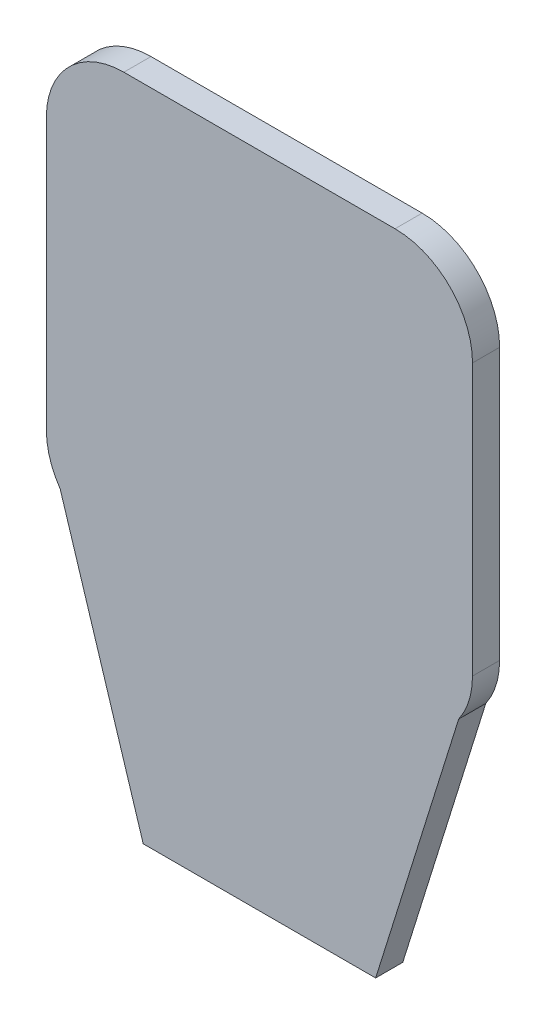
ISO-10303-21;
HEADER;
FILE_DESCRIPTION(('STEP AP214'),'2;1');
FILE_NAME('part.step','',(''),(''),'','','');
FILE_SCHEMA(('AUTOMOTIVE_DESIGN { 1 0 10303 214 1 1 1 1 }'));
ENDSEC;
DATA;
#1=APPLICATION_CONTEXT('core data for automotive mechanical design processes');
#2=APPLICATION_PROTOCOL_DEFINITION('international standard','automotive_design',2000,#1);
#3=PRODUCT_CONTEXT('',#1,'mechanical');
#4=PRODUCT('Part','Part','',(#3));
#5=PRODUCT_RELATED_PRODUCT_CATEGORY('part','',(#4));
#6=PRODUCT_DEFINITION_FORMATION('','',#4);
#7=PRODUCT_DEFINITION_CONTEXT('part definition',#1,'design');
#8=PRODUCT_DEFINITION('design','',#6,#7);
#9=PRODUCT_DEFINITION_SHAPE('','',#8);
#10=(LENGTH_UNIT() NAMED_UNIT(*) SI_UNIT(.MILLI.,.METRE.));
#11=(NAMED_UNIT(*) PLANE_ANGLE_UNIT() SI_UNIT($,.RADIAN.));
#12=(NAMED_UNIT(*) SI_UNIT($,.STERADIAN.) SOLID_ANGLE_UNIT());
#13=UNCERTAINTY_MEASURE_WITH_UNIT(LENGTH_MEASURE(1.E-05),#10,'distance_accuracy_value','');
#14=(GEOMETRIC_REPRESENTATION_CONTEXT(3) GLOBAL_UNCERTAINTY_ASSIGNED_CONTEXT((#13)) GLOBAL_UNIT_ASSIGNED_CONTEXT((#10,
#11,#12)) REPRESENTATION_CONTEXT('',''));
#15=CARTESIAN_POINT('',(0.,0.,0.));
#16=DIRECTION('',(0.,0.,1.));
#17=DIRECTION('',(1.,0.,0.));
#18=AXIS2_PLACEMENT_3D('',#15,#16,#17);
#19=CARTESIAN_POINT('',(15.5923364337388,14.2916666666667,3.5));
#20=DIRECTION('',(0.,0.,-1.));
#21=DIRECTION('',(-1.,0.,0.));
#22=AXIS2_PLACEMENT_3D('',#19,#20,#21);
#23=CYLINDRICAL_SURFACE('',#22,10.);
#24=CARTESIAN_POINT('',(15.5923364337388,14.2916666666667,0.));
#25=DIRECTION('',(0.,0.,1.));
#26=DIRECTION('',(-1.,0.,0.));
#27=AXIS2_PLACEMENT_3D('',#24,#25,#26);
#28=CIRCLE('',#27,10.);
#29=CARTESIAN_POINT('',(25.5923364337388,14.2916666666666,0.));
#30=VERTEX_POINT('',#29);
#31=CARTESIAN_POINT('',(15.5923364337387,24.2916666666667,0.));
#32=VERTEX_POINT('',#31);
#33=EDGE_CURVE('E140',#30,#32,#28,.T.);
#34=ORIENTED_EDGE('',*,*,#33,.T.);
#35=DIRECTION('',(0.,0.,-1.));
#36=VECTOR('',#35,1.);
#37=CARTESIAN_POINT('',(15.5923364337387,24.2916666666667,3.5));
#38=LINE('',#37,#36);
#39=CARTESIAN_POINT('',(15.5923364337387,24.2916666666667,3.5));
#40=VERTEX_POINT('',#39);
#41=EDGE_CURVE('E11',#40,#32,#38,.T.);
#42=ORIENTED_EDGE('',*,*,#41,.F.);
#43=CARTESIAN_POINT('',(15.5923364337388,14.2916666666667,3.5));
#44=DIRECTION('',(0.,0.,1.));
#45=DIRECTION('',(-1.,0.,0.));
#46=AXIS2_PLACEMENT_3D('',#43,#44,#45);
#47=CIRCLE('',#46,10.);
#48=CARTESIAN_POINT('',(25.5923364337388,14.2916666666666,3.5));
#49=VERTEX_POINT('',#48);
#50=EDGE_CURVE('E158',#49,#40,#47,.T.);
#51=ORIENTED_EDGE('',*,*,#50,.F.);
#52=DIRECTION('',(0.,0.,-1.));
#53=VECTOR('',#52,1.);
#54=CARTESIAN_POINT('',(25.5923364337388,14.2916666666666,3.5));
#55=LINE('',#54,#53);
#56=EDGE_CURVE('E136',#49,#30,#55,.T.);
#57=ORIENTED_EDGE('',*,*,#56,.T.);
#58=EDGE_LOOP('',(#34,#42,#51,#57));
#59=FACE_BOUND('',#58,.T.);
#60=ADVANCED_FACE('F32',(#59),#23,.T.);
#61=CARTESIAN_POINT('',(-19.4076635662612,24.2916666666667,3.5));
#62=DIRECTION('',(0.,-1.,0.));
#63=DIRECTION('',(0.,0.,-1.));
#64=AXIS2_PLACEMENT_3D('',#61,#62,#63);
#65=PLANE('',#64);
#66=DIRECTION('',(-1.,0.,0.));
#67=VECTOR('',#66,1.);
#68=CARTESIAN_POINT('',(-19.4076635662612,24.2916666666667,0.));
#69=LINE('',#68,#67);
#70=CARTESIAN_POINT('',(-19.4076635662612,24.2916666666667,0.));
#71=VERTEX_POINT('',#70);
#72=EDGE_CURVE('E143',#32,#71,#69,.T.);
#73=ORIENTED_EDGE('',*,*,#72,.T.);
#74=DIRECTION('',(0.,0.,-1.));
#75=VECTOR('',#74,1.);
#76=CARTESIAN_POINT('',(-19.4076635662612,24.2916666666667,3.5));
#77=LINE('',#76,#75);
#78=CARTESIAN_POINT('',(-19.4076635662612,24.2916666666667,3.5));
#79=VERTEX_POINT('',#78);
#80=EDGE_CURVE('E40',#79,#71,#77,.T.);
#81=ORIENTED_EDGE('',*,*,#80,.F.);
#82=DIRECTION('',(-1.,0.,0.));
#83=VECTOR('',#82,1.);
#84=CARTESIAN_POINT('',(-19.4076635662612,24.2916666666667,3.5));
#85=LINE('',#84,#83);
#86=EDGE_CURVE('E97',#40,#79,#85,.T.);
#87=ORIENTED_EDGE('',*,*,#86,.F.);
#88=ORIENTED_EDGE('',*,*,#41,.T.);
#89=EDGE_LOOP('',(#73,#81,#87,#88));
#90=FACE_BOUND('',#89,.T.);
#91=ADVANCED_FACE('F207',(#90),#65,.F.);
#92=CARTESIAN_POINT('',(-19.4076635662612,14.2916666666667,3.5));
#93=DIRECTION('',(0.,0.,-1.));
#94=DIRECTION('',(-1.,0.,0.));
#95=AXIS2_PLACEMENT_3D('',#92,#93,#94);
#96=CYLINDRICAL_SURFACE('',#95,10.);
#97=CARTESIAN_POINT('',(-19.4076635662612,14.2916666666667,0.));
#98=DIRECTION('',(0.,0.,1.));
#99=DIRECTION('',(1.,0.,0.));
#100=AXIS2_PLACEMENT_3D('',#97,#98,#99);
#101=CIRCLE('',#100,10.);
#102=CARTESIAN_POINT('',(-29.4076635662612,14.2916666666666,0.));
#103=VERTEX_POINT('',#102);
#104=EDGE_CURVE('E145',#71,#103,#101,.T.);
#105=ORIENTED_EDGE('',*,*,#104,.T.);
#106=DIRECTION('',(0.,0.,-1.));
#107=VECTOR('',#106,1.);
#108=CARTESIAN_POINT('',(-29.4076635662612,14.2916666666666,3.5));
#109=LINE('',#108,#107);
#110=CARTESIAN_POINT('',(-29.4076635662612,14.2916666666666,3.5));
#111=VERTEX_POINT('',#110);
#112=EDGE_CURVE('E171',#111,#103,#109,.T.);
#113=ORIENTED_EDGE('',*,*,#112,.F.);
#114=CARTESIAN_POINT('',(-19.4076635662612,14.2916666666667,3.5));
#115=DIRECTION('',(0.,0.,1.));
#116=DIRECTION('',(1.,0.,0.));
#117=AXIS2_PLACEMENT_3D('',#114,#115,#116);
#118=CIRCLE('',#117,10.);
#119=EDGE_CURVE('E179',#79,#111,#118,.T.);
#120=ORIENTED_EDGE('',*,*,#119,.F.);
#121=ORIENTED_EDGE('',*,*,#80,.T.);
#122=EDGE_LOOP('',(#105,#113,#120,#121));
#123=FACE_BOUND('',#122,.T.);
#124=ADVANCED_FACE('F177',(#123),#96,.T.);
#125=CARTESIAN_POINT('',(-29.4076635662612,14.2916666666666,3.5));
#126=DIRECTION('',(1.,0.,0.));
#127=DIRECTION('',(0.,1.,0.));
#128=AXIS2_PLACEMENT_3D('',#125,#126,#127);
#129=PLANE('',#128);
#130=DIRECTION('',(0.,-1.,0.));
#131=VECTOR('',#130,1.);
#132=CARTESIAN_POINT('',(-29.4076635662612,14.2916666666666,0.));
#133=LINE('',#132,#131);
#134=CARTESIAN_POINT('',(-29.4076635662612,-20.7083333333333,0.));
#135=VERTEX_POINT('',#134);
#136=EDGE_CURVE('E147',#103,#135,#133,.T.);
#137=ORIENTED_EDGE('',*,*,#136,.T.);
#138=DIRECTION('',(0.,0.,-1.));
#139=VECTOR('',#138,1.);
#140=CARTESIAN_POINT('',(-29.4076635662612,-20.7083333333333,3.5));
#141=LINE('',#140,#139);
#142=CARTESIAN_POINT('',(-29.4076635662612,-20.7083333333333,3.5));
#143=VERTEX_POINT('',#142);
#144=EDGE_CURVE('E168',#143,#135,#141,.T.);
#145=ORIENTED_EDGE('',*,*,#144,.F.);
#146=DIRECTION('',(0.,-1.,0.));
#147=VECTOR('',#146,1.);
#148=CARTESIAN_POINT('',(-29.4076635662612,14.2916666666666,3.5));
#149=LINE('',#148,#147);
#150=EDGE_CURVE('E197',#111,#143,#149,.T.);
#151=ORIENTED_EDGE('',*,*,#150,.F.);
#152=ORIENTED_EDGE('',*,*,#112,.T.);
#153=EDGE_LOOP('',(#137,#145,#151,#152));
#154=FACE_BOUND('',#153,.T.);
#155=ADVANCED_FACE('F188',(#154),#129,.F.);
#156=CARTESIAN_POINT('',(-19.4076635662612,-20.7083333333333,3.5));
#157=DIRECTION('',(0.,0.,-1.));
#158=DIRECTION('',(-1.,0.,0.));
#159=AXIS2_PLACEMENT_3D('',#156,#157,#158);
#160=CYLINDRICAL_SURFACE('',#159,10.);
#161=CARTESIAN_POINT('',(-19.4076635662612,-20.7083333333333,0.));
#162=DIRECTION('',(0.,0.,1.));
#163=DIRECTION('',(1.,0.,0.));
#164=AXIS2_PLACEMENT_3D('',#161,#162,#163);
#165=CIRCLE('',#164,10.);
#166=CARTESIAN_POINT('',(-27.623489257795,-26.4092287197032,0.));
#167=VERTEX_POINT('',#166);
#168=EDGE_CURVE('E149',#135,#167,#165,.T.);
#169=ORIENTED_EDGE('',*,*,#168,.T.);
#170=DIRECTION('',(0.,0.,-1.));
#171=VECTOR('',#170,1.);
#172=CARTESIAN_POINT('',(-27.623489257795,-26.4092287197032,3.5));
#173=LINE('',#172,#171);
#174=CARTESIAN_POINT('',(-27.623489257795,-26.4092287197032,3.5));
#175=VERTEX_POINT('',#174);
#176=EDGE_CURVE('E165',#175,#167,#173,.T.);
#177=ORIENTED_EDGE('',*,*,#176,.F.);
#178=CARTESIAN_POINT('',(-19.4076635662612,-20.7083333333333,3.5));
#179=DIRECTION('',(0.,0.,1.));
#180=DIRECTION('',(1.,0.,0.));
#181=AXIS2_PLACEMENT_3D('',#178,#179,#180);
#182=CIRCLE('',#181,10.);
#183=EDGE_CURVE('E194',#143,#175,#182,.T.);
#184=ORIENTED_EDGE('',*,*,#183,.F.);
#185=ORIENTED_EDGE('',*,*,#144,.T.);
#186=EDGE_LOOP('',(#169,#177,#184,#185));
#187=FACE_BOUND('',#186,.T.);
#188=ADVANCED_FACE('F192',(#187),#160,.T.);
#189=CARTESIAN_POINT('',(-16.9076635662612,-60.7083333333333,3.5));
#190=DIRECTION('',(0.954500927456525,0.298207946716103,0.));
#191=DIRECTION('',(-0.298207946716103,0.954500927456525,0.));
#192=AXIS2_PLACEMENT_3D('',#189,#190,#191);
#193=PLANE('',#192);
#194=DIRECTION('',(0.298207946716103,-0.954500927456525,0.));
#195=VECTOR('',#194,1.);
#196=CARTESIAN_POINT('',(-16.9076635662612,-60.7083333333333,0.));
#197=LINE('',#196,#195);
#198=CARTESIAN_POINT('',(-16.9076635662612,-60.7083333333333,0.));
#199=VERTEX_POINT('',#198);
#200=EDGE_CURVE('E151',#167,#199,#197,.T.);
#201=ORIENTED_EDGE('',*,*,#200,.T.);
#202=DIRECTION('',(0.,0.,-1.));
#203=VECTOR('',#202,1.);
#204=CARTESIAN_POINT('',(-16.9076635662612,-60.7083333333333,3.5));
#205=LINE('',#204,#203);
#206=CARTESIAN_POINT('',(-16.9076635662612,-60.7083333333333,3.5));
#207=VERTEX_POINT('',#206);
#208=EDGE_CURVE('E162',#207,#199,#205,.T.);
#209=ORIENTED_EDGE('',*,*,#208,.F.);
#210=DIRECTION('',(0.298207946716103,-0.954500927456525,0.));
#211=VECTOR('',#210,1.);
#212=CARTESIAN_POINT('',(-16.9076635662612,-60.7083333333333,3.5));
#213=LINE('',#212,#211);
#214=EDGE_CURVE('E196',#175,#207,#213,.T.);
#215=ORIENTED_EDGE('',*,*,#214,.F.);
#216=ORIENTED_EDGE('',*,*,#176,.T.);
#217=EDGE_LOOP('',(#201,#209,#215,#216));
#218=FACE_BOUND('',#217,.T.);
#219=ADVANCED_FACE('F219',(#218),#193,.F.);
#220=CARTESIAN_POINT('',(-16.9076635662612,-60.7083333333333,3.5));
#221=DIRECTION('',(0.,1.,0.));
#222=DIRECTION('',(0.,0.,1.));
#223=AXIS2_PLACEMENT_3D('',#220,#221,#222);
#224=PLANE('',#223);
#225=DIRECTION('',(1.,0.,0.));
#226=VECTOR('',#225,1.);
#227=CARTESIAN_POINT('',(-16.9076635662612,-60.7083333333333,0.));
#228=LINE('',#227,#226);
#229=CARTESIAN_POINT('',(13.0923364337388,-60.7083333333333,0.));
#230=VERTEX_POINT('',#229);
#231=EDGE_CURVE('E153',#199,#230,#228,.T.);
#232=ORIENTED_EDGE('',*,*,#231,.T.);
#233=DIRECTION('',(0.,0.,-1.));
#234=VECTOR('',#233,1.);
#235=CARTESIAN_POINT('',(13.0923364337388,-60.7083333333333,3.5));
#236=LINE('',#235,#234);
#237=CARTESIAN_POINT('',(13.0923364337388,-60.7083333333333,3.5));
#238=VERTEX_POINT('',#237);
#239=EDGE_CURVE('E131',#238,#230,#236,.T.);
#240=ORIENTED_EDGE('',*,*,#239,.F.);
#241=DIRECTION('',(1.,0.,0.));
#242=VECTOR('',#241,1.);
#243=CARTESIAN_POINT('',(-16.9076635662612,-60.7083333333333,3.5));
#244=LINE('',#243,#242);
#245=EDGE_CURVE('E122',#207,#238,#244,.T.);
#246=ORIENTED_EDGE('',*,*,#245,.F.);
#247=ORIENTED_EDGE('',*,*,#208,.T.);
#248=EDGE_LOOP('',(#232,#240,#246,#247));
#249=FACE_BOUND('',#248,.T.);
#250=ADVANCED_FACE('F222',(#249),#224,.F.);
#251=CARTESIAN_POINT('',(13.0923364337388,-60.7083333333333,3.5));
#252=DIRECTION('',(-0.954500927456527,0.298207946716095,0.));
#253=DIRECTION('',(-0.298207946716095,-0.954500927456527,0.));
#254=AXIS2_PLACEMENT_3D('',#251,#252,#253);
#255=PLANE('',#254);
#256=DIRECTION('',(0.298207946716095,0.954500927456527,0.));
#257=VECTOR('',#256,1.);
#258=CARTESIAN_POINT('',(13.0923364337388,-60.7083333333333,0.));
#259=LINE('',#258,#257);
#260=CARTESIAN_POINT('',(23.8081621252719,-26.4092287197041,0.));
#261=VERTEX_POINT('',#260);
#262=EDGE_CURVE('E130',#230,#261,#259,.T.);
#263=ORIENTED_EDGE('',*,*,#262,.T.);
#264=DIRECTION('',(0.,0.,-1.));
#265=VECTOR('',#264,1.);
#266=CARTESIAN_POINT('',(23.8081621252719,-26.4092287197041,3.5));
#267=LINE('',#266,#265);
#268=CARTESIAN_POINT('',(23.8081621252719,-26.4092287197041,3.5));
#269=VERTEX_POINT('',#268);
#270=EDGE_CURVE('E127',#269,#261,#267,.T.);
#271=ORIENTED_EDGE('',*,*,#270,.F.);
#272=DIRECTION('',(0.298207946716095,0.954500927456527,0.));
#273=VECTOR('',#272,1.);
#274=CARTESIAN_POINT('',(13.0923364337388,-60.7083333333333,3.5));
#275=LINE('',#274,#273);
#276=EDGE_CURVE('E116',#238,#269,#275,.T.);
#277=ORIENTED_EDGE('',*,*,#276,.F.);
#278=ORIENTED_EDGE('',*,*,#239,.T.);
#279=EDGE_LOOP('',(#263,#271,#277,#278));
#280=FACE_BOUND('',#279,.T.);
#281=ADVANCED_FACE('F128',(#280),#255,.F.);
#282=CARTESIAN_POINT('',(15.5923364337388,-20.7083333333333,3.5));
#283=DIRECTION('',(0.,0.,-1.));
#284=DIRECTION('',(-1.,0.,0.));
#285=AXIS2_PLACEMENT_3D('',#282,#283,#284);
#286=CYLINDRICAL_SURFACE('',#285,10.);
#287=CARTESIAN_POINT('',(15.5923364337388,-20.7083333333333,0.));
#288=DIRECTION('',(0.,0.,1.));
#289=DIRECTION('',(1.,0.,0.));
#290=AXIS2_PLACEMENT_3D('',#287,#288,#289);
#291=CIRCLE('',#290,10.);
#292=CARTESIAN_POINT('',(25.5923364337388,-20.7083333333333,0.));
#293=VERTEX_POINT('',#292);
#294=EDGE_CURVE('E83',#261,#293,#291,.T.);
#295=ORIENTED_EDGE('',*,*,#294,.T.);
#296=DIRECTION('',(0.,0.,-1.));
#297=VECTOR('',#296,1.);
#298=CARTESIAN_POINT('',(25.5923364337388,-20.7083333333333,3.5));
#299=LINE('',#298,#297);
#300=CARTESIAN_POINT('',(25.5923364337388,-20.7083333333333,3.5));
#301=VERTEX_POINT('',#300);
#302=EDGE_CURVE('E132',#301,#293,#299,.T.);
#303=ORIENTED_EDGE('',*,*,#302,.F.);
#304=CARTESIAN_POINT('',(15.5923364337388,-20.7083333333333,3.5));
#305=DIRECTION('',(0.,0.,1.));
#306=DIRECTION('',(1.,0.,0.));
#307=AXIS2_PLACEMENT_3D('',#304,#305,#306);
#308=CIRCLE('',#307,10.);
#309=EDGE_CURVE('E120',#269,#301,#308,.T.);
#310=ORIENTED_EDGE('',*,*,#309,.F.);
#311=ORIENTED_EDGE('',*,*,#270,.T.);
#312=EDGE_LOOP('',(#295,#303,#310,#311));
#313=FACE_BOUND('',#312,.T.);
#314=ADVANCED_FACE('F134',(#313),#286,.T.);
#315=CARTESIAN_POINT('',(25.5923364337388,14.2916666666666,3.5));
#316=DIRECTION('',(-1.,0.,0.));
#317=DIRECTION('',(0.,-1.,0.));
#318=AXIS2_PLACEMENT_3D('',#315,#316,#317);
#319=PLANE('',#318);
#320=DIRECTION('',(0.,1.,0.));
#321=VECTOR('',#320,1.);
#322=CARTESIAN_POINT('',(25.5923364337388,14.2916666666666,0.));
#323=LINE('',#322,#321);
#324=EDGE_CURVE('E89',#293,#30,#323,.T.);
#325=ORIENTED_EDGE('',*,*,#324,.T.);
#326=ORIENTED_EDGE('',*,*,#56,.F.);
#327=DIRECTION('',(0.,1.,0.));
#328=VECTOR('',#327,1.);
#329=CARTESIAN_POINT('',(25.5923364337388,14.2916666666666,3.5));
#330=LINE('',#329,#328);
#331=EDGE_CURVE('E48',#301,#49,#330,.T.);
#332=ORIENTED_EDGE('',*,*,#331,.F.);
#333=ORIENTED_EDGE('',*,*,#302,.T.);
#334=EDGE_LOOP('',(#325,#326,#332,#333));
#335=FACE_BOUND('',#334,.T.);
#336=ADVANCED_FACE('F231',(#335),#319,.F.);
#337=CARTESIAN_POINT('',(15.5923364337388,14.2916666666667,3.5));
#338=DIRECTION('',(0.,0.,-1.));
#339=DIRECTION('',(-1.,0.,0.));
#340=AXIS2_PLACEMENT_3D('',#337,#338,#339);
#341=PLANE('',#340);
#342=ORIENTED_EDGE('',*,*,#50,.T.);
#343=ORIENTED_EDGE('',*,*,#86,.T.);
#344=ORIENTED_EDGE('',*,*,#119,.T.);
#345=ORIENTED_EDGE('',*,*,#150,.T.);
#346=ORIENTED_EDGE('',*,*,#183,.T.);
#347=ORIENTED_EDGE('',*,*,#214,.T.);
#348=ORIENTED_EDGE('',*,*,#245,.T.);
#349=ORIENTED_EDGE('',*,*,#276,.T.);
#350=ORIENTED_EDGE('',*,*,#309,.T.);
#351=ORIENTED_EDGE('',*,*,#331,.T.);
#352=EDGE_LOOP('',(#342,#343,#344,#345,#346,#347,#348,#349,#350,#351));
#353=FACE_BOUND('',#352,.T.);
#354=ADVANCED_FACE('F118',(#353),#341,.F.);
#355=CARTESIAN_POINT('',(15.5923364337388,14.2916666666667,0.));
#356=DIRECTION('',(0.,0.,-1.));
#357=DIRECTION('',(-1.,0.,0.));
#358=AXIS2_PLACEMENT_3D('',#355,#356,#357);
#359=PLANE('',#358);
#360=ORIENTED_EDGE('',*,*,#33,.F.);
#361=ORIENTED_EDGE('',*,*,#324,.F.);
#362=ORIENTED_EDGE('',*,*,#294,.F.);
#363=ORIENTED_EDGE('',*,*,#262,.F.);
#364=ORIENTED_EDGE('',*,*,#231,.F.);
#365=ORIENTED_EDGE('',*,*,#200,.F.);
#366=ORIENTED_EDGE('',*,*,#168,.F.);
#367=ORIENTED_EDGE('',*,*,#136,.F.);
#368=ORIENTED_EDGE('',*,*,#104,.F.);
#369=ORIENTED_EDGE('',*,*,#72,.F.);
#370=EDGE_LOOP('',(#360,#361,#362,#363,#364,#365,#366,#367,#368,#369));
#371=FACE_BOUND('',#370,.T.);
#372=ADVANCED_FACE('F183',(#371),#359,.T.);
#373=CLOSED_SHELL('',(#60,#91,#124,#155,#188,#219,#250,#281,#314,#336,#354,#372));
#374=MANIFOLD_SOLID_BREP('B2',#373);
#375=ADVANCED_BREP_SHAPE_REPRESENTATION('',(#18,#374),#14);
#376=SHAPE_DEFINITION_REPRESENTATION(#9,#375);
ENDSEC;
END-ISO-10303-21;
